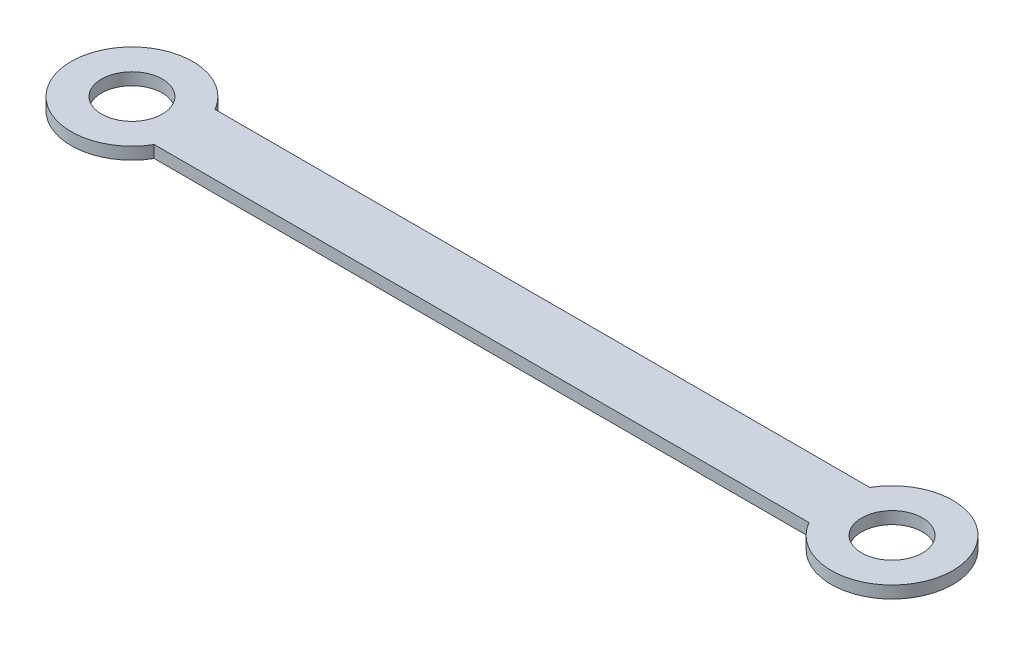
ISO-10303-21;
HEADER;
FILE_DESCRIPTION(('STEP AP214'),'2;1');
FILE_NAME('part.step','',(''),(''),'','','');
FILE_SCHEMA(('AUTOMOTIVE_DESIGN { 1 0 10303 214 1 1 1 1 }'));
ENDSEC;
DATA;
#1=APPLICATION_CONTEXT('core data for automotive mechanical design processes');
#2=APPLICATION_PROTOCOL_DEFINITION('international standard','automotive_design',2000,#1);
#3=PRODUCT_CONTEXT('',#1,'mechanical');
#4=PRODUCT('Part','Part','',(#3));
#5=PRODUCT_RELATED_PRODUCT_CATEGORY('part','',(#4));
#6=PRODUCT_DEFINITION_FORMATION('','',#4);
#7=PRODUCT_DEFINITION_CONTEXT('part definition',#1,'design');
#8=PRODUCT_DEFINITION('design','',#6,#7);
#9=PRODUCT_DEFINITION_SHAPE('','',#8);
#10=(LENGTH_UNIT() NAMED_UNIT(*) SI_UNIT(.MILLI.,.METRE.));
#11=(NAMED_UNIT(*) PLANE_ANGLE_UNIT() SI_UNIT($,.RADIAN.));
#12=(NAMED_UNIT(*) SI_UNIT($,.STERADIAN.) SOLID_ANGLE_UNIT());
#13=UNCERTAINTY_MEASURE_WITH_UNIT(LENGTH_MEASURE(1.E-05),#10,'distance_accuracy_value','');
#14=(GEOMETRIC_REPRESENTATION_CONTEXT(3) GLOBAL_UNCERTAINTY_ASSIGNED_CONTEXT((#13)) GLOBAL_UNIT_ASSIGNED_CONTEXT((#10,
#11,#12)) REPRESENTATION_CONTEXT('',''));
#15=CARTESIAN_POINT('',(0.,0.,0.));
#16=DIRECTION('',(0.,0.,1.));
#17=DIRECTION('',(1.,0.,0.));
#18=AXIS2_PLACEMENT_3D('',#15,#16,#17);
#19=CARTESIAN_POINT('',(125.,2.,0.));
#20=DIRECTION('',(0.,1.,0.));
#21=DIRECTION('',(0.,0.,1.));
#22=AXIS2_PLACEMENT_3D('',#19,#20,#21);
#23=PLANE('',#22);
#24=CARTESIAN_POINT('',(0.,2.,0.));
#25=DIRECTION('',(0.,1.,0.));
#26=DIRECTION('',(0.,0.,1.));
#27=AXIS2_PLACEMENT_3D('',#24,#25,#26);
#28=CIRCLE('',#27,5.);
#29=CARTESIAN_POINT('',(0.,2.,5.));
#30=VERTEX_POINT('',#29);
#31=EDGE_CURVE('E112',#30,#30,#28,.T.);
#32=ORIENTED_EDGE('',*,*,#31,.F.);
#33=EDGE_LOOP('',(#32));
#34=FACE_BOUND('',#33,.T.);
#35=CARTESIAN_POINT('',(125.,2.,0.));
#36=DIRECTION('',(0.,1.,0.));
#37=DIRECTION('',(0.,0.,1.));
#38=AXIS2_PLACEMENT_3D('',#35,#36,#37);
#39=CIRCLE('',#38,10.);
#40=CARTESIAN_POINT('',(116.339745962156,2.,5.));
#41=VERTEX_POINT('',#40);
#42=CARTESIAN_POINT('',(116.339745962156,2.,-5.));
#43=VERTEX_POINT('',#42);
#44=EDGE_CURVE('E92',#41,#43,#39,.T.);
#45=ORIENTED_EDGE('',*,*,#44,.T.);
#46=DIRECTION('',(-1.,0.,0.));
#47=VECTOR('',#46,1.);
#48=CARTESIAN_POINT('',(116.339745962156,2.,-5.));
#49=LINE('',#48,#47);
#50=CARTESIAN_POINT('',(8.66025403784439,2.,-4.99999999999999));
#51=VERTEX_POINT('',#50);
#52=EDGE_CURVE('E87',#43,#51,#49,.T.);
#53=ORIENTED_EDGE('',*,*,#52,.T.);
#54=CARTESIAN_POINT('',(0.,2.,0.));
#55=DIRECTION('',(0.,1.,0.));
#56=DIRECTION('',(0.,0.,1.));
#57=AXIS2_PLACEMENT_3D('',#54,#55,#56);
#58=CIRCLE('',#57,10.);
#59=CARTESIAN_POINT('',(8.66025403784439,2.,4.99999999999999));
#60=VERTEX_POINT('',#59);
#61=EDGE_CURVE('E90',#51,#60,#58,.T.);
#62=ORIENTED_EDGE('',*,*,#61,.T.);
#63=DIRECTION('',(1.,0.,0.));
#64=VECTOR('',#63,1.);
#65=CARTESIAN_POINT('',(8.66025403784439,2.,4.99999999999999));
#66=LINE('',#65,#64);
#67=EDGE_CURVE('E57',#60,#41,#66,.T.);
#68=ORIENTED_EDGE('',*,*,#67,.T.);
#69=EDGE_LOOP('',(#45,#53,#62,#68));
#70=FACE_BOUND('',#69,.T.);
#71=CARTESIAN_POINT('',(125.,2.,0.));
#72=DIRECTION('',(0.,1.,0.));
#73=DIRECTION('',(0.,0.,1.));
#74=AXIS2_PLACEMENT_3D('',#71,#72,#73);
#75=CIRCLE('',#74,4.99999999999999);
#76=CARTESIAN_POINT('',(125.,2.,4.99999999999999));
#77=VERTEX_POINT('',#76);
#78=EDGE_CURVE('E134',#77,#77,#75,.T.);
#79=ORIENTED_EDGE('',*,*,#78,.F.);
#80=EDGE_LOOP('',(#79));
#81=FACE_BOUND('',#80,.T.);
#82=ADVANCED_FACE('F39',(#34,#70,#81),#23,.T.);
#83=CARTESIAN_POINT('',(125.,0.,0.));
#84=DIRECTION('',(0.,1.,0.));
#85=DIRECTION('',(0.,0.,1.));
#86=AXIS2_PLACEMENT_3D('',#83,#84,#85);
#87=PLANE('',#86);
#88=CARTESIAN_POINT('',(125.,0.,0.));
#89=DIRECTION('',(0.,1.,0.));
#90=DIRECTION('',(0.,0.,1.));
#91=AXIS2_PLACEMENT_3D('',#88,#89,#90);
#92=CIRCLE('',#91,10.);
#93=CARTESIAN_POINT('',(116.339745962156,0.,5.));
#94=VERTEX_POINT('',#93);
#95=CARTESIAN_POINT('',(116.339745962156,0.,-5.));
#96=VERTEX_POINT('',#95);
#97=EDGE_CURVE('E108',#94,#96,#92,.T.);
#98=ORIENTED_EDGE('',*,*,#97,.F.);
#99=DIRECTION('',(1.,0.,0.));
#100=VECTOR('',#99,1.);
#101=CARTESIAN_POINT('',(8.66025403784439,0.,4.99999999999999));
#102=LINE('',#101,#100);
#103=CARTESIAN_POINT('',(8.66025403784439,0.,4.99999999999999));
#104=VERTEX_POINT('',#103);
#105=EDGE_CURVE('E80',#104,#94,#102,.T.);
#106=ORIENTED_EDGE('',*,*,#105,.F.);
#107=CARTESIAN_POINT('',(0.,0.,0.));
#108=DIRECTION('',(0.,1.,0.));
#109=DIRECTION('',(0.,0.,1.));
#110=AXIS2_PLACEMENT_3D('',#107,#108,#109);
#111=CIRCLE('',#110,10.);
#112=CARTESIAN_POINT('',(8.66025403784439,0.,-4.99999999999999));
#113=VERTEX_POINT('',#112);
#114=EDGE_CURVE('E74',#113,#104,#111,.T.);
#115=ORIENTED_EDGE('',*,*,#114,.F.);
#116=DIRECTION('',(-1.,0.,0.));
#117=VECTOR('',#116,1.);
#118=CARTESIAN_POINT('',(116.339745962156,0.,-5.));
#119=LINE('',#118,#117);
#120=EDGE_CURVE('E97',#96,#113,#119,.T.);
#121=ORIENTED_EDGE('',*,*,#120,.F.);
#122=EDGE_LOOP('',(#98,#106,#115,#121));
#123=FACE_BOUND('',#122,.T.);
#124=CARTESIAN_POINT('',(0.,0.,0.));
#125=DIRECTION('',(0.,1.,0.));
#126=DIRECTION('',(0.,0.,1.));
#127=AXIS2_PLACEMENT_3D('',#124,#125,#126);
#128=CIRCLE('',#127,5.);
#129=CARTESIAN_POINT('',(0.,0.,5.));
#130=VERTEX_POINT('',#129);
#131=EDGE_CURVE('E130',#130,#130,#128,.T.);
#132=ORIENTED_EDGE('',*,*,#131,.T.);
#133=EDGE_LOOP('',(#132));
#134=FACE_BOUND('',#133,.T.);
#135=CARTESIAN_POINT('',(125.,0.,0.));
#136=DIRECTION('',(0.,1.,0.));
#137=DIRECTION('',(0.,0.,1.));
#138=AXIS2_PLACEMENT_3D('',#135,#136,#137);
#139=CIRCLE('',#138,4.99999999999999);
#140=CARTESIAN_POINT('',(125.,0.,4.99999999999999));
#141=VERTEX_POINT('',#140);
#142=EDGE_CURVE('E138',#141,#141,#139,.T.);
#143=ORIENTED_EDGE('',*,*,#142,.T.);
#144=EDGE_LOOP('',(#143));
#145=FACE_BOUND('',#144,.T.);
#146=ADVANCED_FACE('F125',(#123,#134,#145),#87,.F.);
#147=CARTESIAN_POINT('',(125.,2.,0.));
#148=DIRECTION('',(0.,-1.,0.));
#149=DIRECTION('',(0.,0.,-1.));
#150=AXIS2_PLACEMENT_3D('',#147,#148,#149);
#151=CYLINDRICAL_SURFACE('',#150,10.);
#152=ORIENTED_EDGE('',*,*,#97,.T.);
#153=DIRECTION('',(0.,-1.,0.));
#154=VECTOR('',#153,1.);
#155=CARTESIAN_POINT('',(116.339745962156,2.,-5.));
#156=LINE('',#155,#154);
#157=EDGE_CURVE('E11',#43,#96,#156,.T.);
#158=ORIENTED_EDGE('',*,*,#157,.F.);
#159=ORIENTED_EDGE('',*,*,#44,.F.);
#160=DIRECTION('',(0.,-1.,0.));
#161=VECTOR('',#160,1.);
#162=CARTESIAN_POINT('',(116.339745962156,2.,5.));
#163=LINE('',#162,#161);
#164=EDGE_CURVE('E104',#41,#94,#163,.T.);
#165=ORIENTED_EDGE('',*,*,#164,.T.);
#166=EDGE_LOOP('',(#152,#158,#159,#165));
#167=FACE_BOUND('',#166,.T.);
#168=ADVANCED_FACE('F41',(#167),#151,.T.);
#169=CARTESIAN_POINT('',(116.339745962156,2.,-5.));
#170=DIRECTION('',(0.,0.,1.));
#171=DIRECTION('',(1.,0.,0.));
#172=AXIS2_PLACEMENT_3D('',#169,#170,#171);
#173=PLANE('',#172);
#174=ORIENTED_EDGE('',*,*,#120,.T.);
#175=DIRECTION('',(0.,-1.,0.));
#176=VECTOR('',#175,1.);
#177=CARTESIAN_POINT('',(8.66025403784439,2.,-4.99999999999999));
#178=LINE('',#177,#176);
#179=EDGE_CURVE('E49',#51,#113,#178,.T.);
#180=ORIENTED_EDGE('',*,*,#179,.F.);
#181=ORIENTED_EDGE('',*,*,#52,.F.);
#182=ORIENTED_EDGE('',*,*,#157,.T.);
#183=EDGE_LOOP('',(#174,#180,#181,#182));
#184=FACE_BOUND('',#183,.T.);
#185=ADVANCED_FACE('F96',(#184),#173,.F.);
#186=CARTESIAN_POINT('',(0.,2.,0.));
#187=DIRECTION('',(0.,-1.,0.));
#188=DIRECTION('',(0.,0.,-1.));
#189=AXIS2_PLACEMENT_3D('',#186,#187,#188);
#190=CYLINDRICAL_SURFACE('',#189,10.);
#191=ORIENTED_EDGE('',*,*,#114,.T.);
#192=DIRECTION('',(0.,-1.,0.));
#193=VECTOR('',#192,1.);
#194=CARTESIAN_POINT('',(8.66025403784439,2.,4.99999999999999));
#195=LINE('',#194,#193);
#196=EDGE_CURVE('E99',#60,#104,#195,.T.);
#197=ORIENTED_EDGE('',*,*,#196,.F.);
#198=ORIENTED_EDGE('',*,*,#61,.F.);
#199=ORIENTED_EDGE('',*,*,#179,.T.);
#200=EDGE_LOOP('',(#191,#197,#198,#199));
#201=FACE_BOUND('',#200,.T.);
#202=ADVANCED_FACE('F100',(#201),#190,.T.);
#203=CARTESIAN_POINT('',(8.66025403784439,2.,4.99999999999999));
#204=DIRECTION('',(0.,0.,-1.));
#205=DIRECTION('',(-1.,0.,0.));
#206=AXIS2_PLACEMENT_3D('',#203,#204,#205);
#207=PLANE('',#206);
#208=ORIENTED_EDGE('',*,*,#105,.T.);
#209=ORIENTED_EDGE('',*,*,#164,.F.);
#210=ORIENTED_EDGE('',*,*,#67,.F.);
#211=ORIENTED_EDGE('',*,*,#196,.T.);
#212=EDGE_LOOP('',(#208,#209,#210,#211));
#213=FACE_BOUND('',#212,.T.);
#214=ADVANCED_FACE('F122',(#213),#207,.F.);
#215=CARTESIAN_POINT('',(0.,2.,0.));
#216=DIRECTION('',(0.,-1.,0.));
#217=DIRECTION('',(0.,0.,-1.));
#218=AXIS2_PLACEMENT_3D('',#215,#216,#217);
#219=CYLINDRICAL_SURFACE('',#218,5.);
#220=ORIENTED_EDGE('',*,*,#31,.T.);
#221=EDGE_LOOP('',(#220));
#222=FACE_BOUND('',#221,.T.);
#223=ORIENTED_EDGE('',*,*,#131,.F.);
#224=EDGE_LOOP('',(#223));
#225=FACE_BOUND('',#224,.T.);
#226=ADVANCED_FACE('F157',(#222,#225),#219,.F.);
#227=CARTESIAN_POINT('',(125.,2.,0.));
#228=DIRECTION('',(0.,-1.,0.));
#229=DIRECTION('',(0.,0.,-1.));
#230=AXIS2_PLACEMENT_3D('',#227,#228,#229);
#231=CYLINDRICAL_SURFACE('',#230,4.99999999999999);
#232=ORIENTED_EDGE('',*,*,#78,.T.);
#233=EDGE_LOOP('',(#232));
#234=FACE_BOUND('',#233,.T.);
#235=ORIENTED_EDGE('',*,*,#142,.F.);
#236=EDGE_LOOP('',(#235));
#237=FACE_BOUND('',#236,.T.);
#238=ADVANCED_FACE('F146',(#234,#237),#231,.F.);
#239=CLOSED_SHELL('',(#82,#146,#168,#185,#202,#214,#226,#238));
#240=MANIFOLD_SOLID_BREP('B2',#239);
#241=ADVANCED_BREP_SHAPE_REPRESENTATION('',(#18,#240),#14);
#242=SHAPE_DEFINITION_REPRESENTATION(#9,#241);
ENDSEC;
END-ISO-10303-21;
